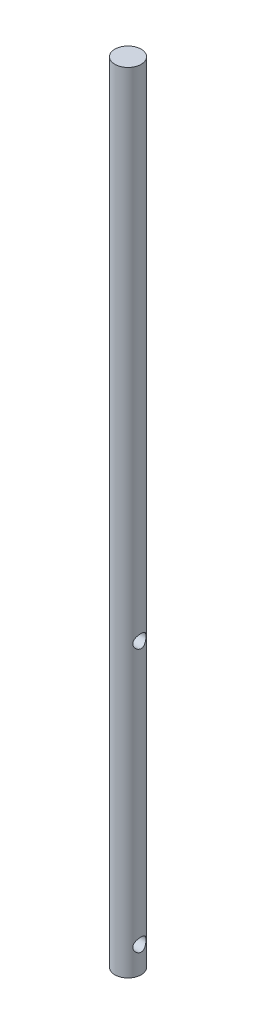
ISO-10303-21;
HEADER;
FILE_DESCRIPTION(('STEP AP214'),'2;1');
FILE_NAME('part.step','',(''),(''),'','','');
FILE_SCHEMA(('AUTOMOTIVE_DESIGN { 1 0 10303 214 1 1 1 1 }'));
ENDSEC;
DATA;
#1=APPLICATION_CONTEXT('core data for automotive mechanical design processes');
#2=APPLICATION_PROTOCOL_DEFINITION('international standard','automotive_design',2000,#1);
#3=PRODUCT_CONTEXT('',#1,'mechanical');
#4=PRODUCT('Part','Part','',(#3));
#5=PRODUCT_RELATED_PRODUCT_CATEGORY('part','',(#4));
#6=PRODUCT_DEFINITION_FORMATION('','',#4);
#7=PRODUCT_DEFINITION_CONTEXT('part definition',#1,'design');
#8=PRODUCT_DEFINITION('design','',#6,#7);
#9=PRODUCT_DEFINITION_SHAPE('','',#8);
#10=(LENGTH_UNIT() NAMED_UNIT(*) SI_UNIT(.MILLI.,.METRE.));
#11=(NAMED_UNIT(*) PLANE_ANGLE_UNIT() SI_UNIT($,.RADIAN.));
#12=(NAMED_UNIT(*) SI_UNIT($,.STERADIAN.) SOLID_ANGLE_UNIT());
#13=UNCERTAINTY_MEASURE_WITH_UNIT(LENGTH_MEASURE(1.E-05),#10,'distance_accuracy_value','');
#14=(GEOMETRIC_REPRESENTATION_CONTEXT(3) GLOBAL_UNCERTAINTY_ASSIGNED_CONTEXT((#13)) GLOBAL_UNIT_ASSIGNED_CONTEXT((#10,
#11,#12)) REPRESENTATION_CONTEXT('',''));
#15=CARTESIAN_POINT('',(0.,0.,0.));
#16=DIRECTION('',(0.,0.,1.));
#17=DIRECTION('',(1.,0.,0.));
#18=AXIS2_PLACEMENT_3D('',#15,#16,#17);
#19=CARTESIAN_POINT('',(0.,300.,0.));
#20=DIRECTION('',(0.,1.,0.));
#21=DIRECTION('',(0.,0.,1.));
#22=AXIS2_PLACEMENT_3D('',#19,#20,#21);
#23=PLANE('',#22);
#24=CARTESIAN_POINT('',(0.,300.,0.));
#25=DIRECTION('',(0.,-1.,0.));
#26=DIRECTION('',(0.,0.,-1.));
#27=AXIS2_PLACEMENT_3D('',#24,#25,#26);
#28=CIRCLE('',#27,5.);
#29=CARTESIAN_POINT('',(0.,300.,-5.));
#30=VERTEX_POINT('',#29);
#31=EDGE_CURVE('E75',#30,#30,#28,.T.);
#32=ORIENTED_EDGE('',*,*,#31,.F.);
#33=EDGE_LOOP('',(#32));
#34=FACE_BOUND('',#33,.T.);
#35=ADVANCED_FACE('F33',(#34),#23,.T.);
#36=CARTESIAN_POINT('',(0.,0.,0.));
#37=DIRECTION('',(0.,-1.,0.));
#38=DIRECTION('',(0.,0.,-1.));
#39=AXIS2_PLACEMENT_3D('',#36,#37,#38);
#40=CYLINDRICAL_SURFACE('',#39,5.);
#41=CARTESIAN_POINT('',(-4.33012701892239,110.,-2.49999999999965));
#42=CARTESIAN_POINT('',(-4.33013982273012,109.869733493124,-2.49998948436397));
#43=CARTESIAN_POINT('',(-4.33609541965603,109.739297279324,-2.48974954513133));
#44=CARTESIAN_POINT('',(-4.35905877051927,109.482431028471,-2.44930840724908));
#45=CARTESIAN_POINT('',(-4.37608974726042,109.356009995943,-2.41906526369509));
#46=CARTESIAN_POINT('',(-4.41873376871678,109.111371054439,-2.34024976997534));
#47=CARTESIAN_POINT('',(-4.4443011133894,108.993113426438,-2.29177485369926));
#48=CARTESIAN_POINT('',(-4.50106659111473,108.766439436905,-2.17816884056377));
#49=CARTESIAN_POINT('',(-4.53226502875901,108.658023608204,-2.11303684262633));
#50=CARTESIAN_POINT('',(-4.59992173524867,108.444235696083,-1.96166634317214));
#51=CARTESIAN_POINT('',(-4.63660159331593,108.33985216551,-1.87413008816877));
#52=CARTESIAN_POINT('',(-4.70929956727467,108.146479024287,-1.68313452122711));
#53=CARTESIAN_POINT('',(-4.74531734512781,108.057497092245,-1.57966731506011));
#54=CARTESIAN_POINT('',(-4.81553692452146,107.891582123514,-1.35122390789041));
#55=CARTESIAN_POINT('',(-4.84945266064082,107.815865580721,-1.22526797235854));
#56=CARTESIAN_POINT('',(-4.90876890230201,107.687147866516,-0.96039256667074));
#57=CARTESIAN_POINT('',(-4.93417477954541,107.634132359562,-0.821481345389576));
#58=CARTESIAN_POINT('',(-4.97201153115074,107.556238346836,-0.54511235977312));
#59=CARTESIAN_POINT('',(-4.98523700553428,107.529626184135,-0.408254476210585));
#60=CARTESIAN_POINT('',(-5.00018959613973,107.499584703289,-0.13142657175529));
#61=CARTESIAN_POINT('',(-5.00192366961168,107.496141358005,0.00854151460688804));
#62=CARTESIAN_POINT('',(-4.99407454791403,107.511866684931,0.274581311062335));
#63=CARTESIAN_POINT('',(-4.98546239730473,107.529095038805,0.400802997943041));
#64=CARTESIAN_POINT('',(-4.95935613149289,107.58220210976,0.648284429795474));
#65=CARTESIAN_POINT('',(-4.94186135165958,107.61808222244,0.769543802734988));
#66=CARTESIAN_POINT('',(-4.89928958219149,107.707706415225,1.00577347892443));
#67=CARTESIAN_POINT('',(-4.87411103822995,107.76169078293,1.12063355878835));
#68=CARTESIAN_POINT('',(-4.81844114966702,107.885658540504,1.33994200378363));
#69=CARTESIAN_POINT('',(-4.78794790393698,107.955647658256,1.44438662209695));
#70=CARTESIAN_POINT('',(-4.72110985998062,108.117238378833,1.65043415224586));
#71=CARTESIAN_POINT('',(-4.68448439995425,108.210257570815,1.75083518757376));
#72=CARTESIAN_POINT('',(-4.61135851467013,108.411474312325,1.93526092574481));
#73=CARTESIAN_POINT('',(-4.57485820664055,108.519683430685,2.01927302893594));
#74=CARTESIAN_POINT('',(-4.50360390231194,108.75662048106,2.1737633366059));
#75=CARTESIAN_POINT('',(-4.4691079997675,108.886215057636,2.24304328744549));
#76=CARTESIAN_POINT('',(-4.4093862569642,109.157344178398,2.35829778250344));
#77=CARTESIAN_POINT('',(-4.38415075115148,109.298866082544,2.40429664552759));
#78=CARTESIAN_POINT('',(-4.34861589542565,109.578036278207,2.46795052756296));
#79=CARTESIAN_POINT('',(-4.3372913962122,109.715102797609,2.48756280530029));
#80=CARTESIAN_POINT('',(-4.32794798404003,109.991003353791,2.50379236652891));
#81=CARTESIAN_POINT('',(-4.32991967223259,110.1298360728,2.50042589328791));
#82=CARTESIAN_POINT('',(-4.34585841351442,110.389134796447,2.47259010836025));
#83=CARTESIAN_POINT('',(-4.35848968766616,110.50994862777,2.4504695417815));
#84=CARTESIAN_POINT('',(-4.39235053878334,110.745919465678,2.38924071158146));
#85=CARTESIAN_POINT('',(-4.41358290012566,110.861074626867,2.35012694655943));
#86=CARTESIAN_POINT('',(-4.46340555199123,111.088528327256,2.25411897151252));
#87=CARTESIAN_POINT('',(-4.49229108107639,111.200447542133,2.19648515923198));
#88=CARTESIAN_POINT('',(-4.55390298743108,111.413673178849,2.06571766004006));
#89=CARTESIAN_POINT('',(-4.58663133387856,111.514974108788,1.9925760108316));
#90=CARTESIAN_POINT('',(-4.65719996140822,111.717446918803,1.82209291799672));
#91=CARTESIAN_POINT('',(-4.69516457885694,111.816992876772,1.72286318078471));
#92=CARTESIAN_POINT('',(-4.76835587444734,111.998530595006,1.50851123849917));
#93=CARTESIAN_POINT('',(-4.80358162519318,112.080516425659,1.39338368665026));
#94=CARTESIAN_POINT('',(-4.86853404227325,112.226434314791,1.14633840638546));
#95=CARTESIAN_POINT('',(-4.89809104179847,112.289832795208,1.014057743891));
#96=CARTESIAN_POINT('',(-4.94708387398465,112.392844759962,0.738805911647701));
#97=CARTESIAN_POINT('',(-4.96652859191741,112.432479129605,0.595844253647433));
#98=CARTESIAN_POINT('',(-4.99168770453965,112.483421409356,0.317449205675065));
#99=CARTESIAN_POINT('',(-4.99849819767836,112.49699468583,0.182528609085732));
#100=CARTESIAN_POINT('',(-5.00105325940468,112.502108167495,-0.0878149643370817));
#101=CARTESIAN_POINT('',(-4.99680170177043,112.493656085661,-0.223237748726671));
#102=CARTESIAN_POINT('',(-4.9783492208564,112.456458969604,-0.481344982670734));
#103=CARTESIAN_POINT('',(-4.9648223663681,112.429087828364,-0.604280801321436));
#104=CARTESIAN_POINT('',(-4.92980234191736,112.356682550242,-0.84361487366412));
#105=CARTESIAN_POINT('',(-4.90830802955524,112.311645880366,-0.960012187086878));
#106=CARTESIAN_POINT('',(-4.85814826741496,112.203182181261,-1.18855854199559));
#107=CARTESIAN_POINT('',(-4.82921542506811,112.13905097531,-1.30031295715329));
#108=CARTESIAN_POINT('',(-4.76720333344996,111.995105889852,-1.51193650408501));
#109=CARTESIAN_POINT('',(-4.73412218229116,111.915284807373,-1.61180014305363));
#110=CARTESIAN_POINT('',(-4.66321523550938,111.733004205551,-1.80728542324335));
#111=CARTESIAN_POINT('',(-4.6252448965838,111.629082273999,-1.90149582348968));
#112=CARTESIAN_POINT('',(-4.55157698284956,111.406384714618,-2.07165660492469));
#113=CARTESIAN_POINT('',(-4.51588143910601,111.287596085801,-2.14759083151505));
#114=CARTESIAN_POINT('',(-4.44998982823944,111.033363882336,-2.28108393395993));
#115=CARTESIAN_POINT('',(-4.42000320347002,110.897512611575,-2.33798627977414));
#116=CARTESIAN_POINT('',(-4.38370272660113,110.68677735048,-2.40494911880423));
#117=CARTESIAN_POINT('',(-4.37305486646074,110.615440224302,-2.42419582683955));
#118=CARTESIAN_POINT('',(-4.35507574170955,110.470959303151,-2.45635087255753));
#119=CARTESIAN_POINT('',(-4.34774215854254,110.397816809046,-2.46926364179141));
#120=CARTESIAN_POINT('',(-4.3382377954294,110.270499013453,-2.48591166201388));
#121=CARTESIAN_POINT('',(-4.33520487024811,110.216583678488,-2.49118864979167));
#122=CARTESIAN_POINT('',(-4.33114674911343,110.10845538369,-2.49823512543898));
#123=CARTESIAN_POINT('',(-4.33012168747281,110.054242404189,-2.50000437866439));
#124=CARTESIAN_POINT('',(-4.33012701892239,110.,-2.49999999999965));
#125=B_SPLINE_CURVE_WITH_KNOTS('',3,(#41,#42,#43,#44,#45,#46,#47,#48,#49,#50,#51,#52,#53,#54,
#55,#56,#57,#58,#59,#60,#61,#62,#63,#64,#65,#66,#67,#68,#69,#70,#71,#72,#73,#74,#75,#76,#77,#78,
#79,#80,#81,#82,#83,#84,#85,#86,#87,#88,#89,#90,#91,#92,#93,#94,#95,#96,#97,#98,#99,#100,#101,
#102,#103,#104,#105,#106,#107,#108,#109,#110,#111,#112,#113,#114,#115,#116,#117,#118,#119,#120,
#121,#122,#123,#124),.UNSPECIFIED.,.T.,.F.,(4,2,2,2,2,2,2,2,2,2,2,2,2,2,2,2,2,2,2,2,2,2,2,2,2,2,
2,2,2,2,2,2,2,2,2,2,2,2,2,2,2,4),(0.,0.390580306486802,0.781982232062036,1.17132148982696,
1.56068181366376,1.98215578129647,2.40383927716016,2.85394730601995,3.30377067414813,
3.72158712424921,4.13915059220181,4.52040243716427,4.90168281298718,5.28823836832948,
5.67493248380762,6.09817978647309,6.52175120619882,6.97222104328708,7.42221935534351,
7.83655727140617,8.25060232976017,8.61935458565148,8.98822631095238,9.37418241020299,
9.76033715555198,10.1951685895661,10.6301466245059,11.076604535375,11.5226694952701,
11.927806759788,12.3328021699001,12.7111106218382,13.0894733378512,13.4840187680376,
13.8787457525688,14.3127560463025,14.7471485711797,15.1952687260159,15.4189244153949,
15.6424233996907,15.8050484542806,15.9676843870379),.UNSPECIFIED.);
#126=CARTESIAN_POINT('',(-4.33012701892239,110.,-2.49999999999965));
#127=VERTEX_POINT('',#126);
#128=EDGE_CURVE('E10',#127,#127,#125,.T.);
#129=ORIENTED_EDGE('',*,*,#128,.F.);
#130=EDGE_LOOP('',(#129));
#131=FACE_BOUND('',#130,.T.);
#132=CARTESIAN_POINT('',(4.33012701892239,110.,-2.49999999999965));
#133=CARTESIAN_POINT('',(4.33013982273012,110.130266506877,-2.49998948436397));
#134=CARTESIAN_POINT('',(4.33609541965603,110.260702720676,-2.48974954513133));
#135=CARTESIAN_POINT('',(4.35905877051927,110.517568971529,-2.44930840724908));
#136=CARTESIAN_POINT('',(4.37608974726042,110.643990004057,-2.41906526369509));
#137=CARTESIAN_POINT('',(4.41873376871678,110.888628945561,-2.34024976997534));
#138=CARTESIAN_POINT('',(4.4443011133894,111.006886573562,-2.29177485369926));
#139=CARTESIAN_POINT('',(4.50106659111473,111.233560563095,-2.17816884056377));
#140=CARTESIAN_POINT('',(4.53226502875901,111.341976391796,-2.11303684262633));
#141=CARTESIAN_POINT('',(4.59992173524867,111.555764303917,-1.96166634317214));
#142=CARTESIAN_POINT('',(4.63660159331593,111.66014783449,-1.87413008816877));
#143=CARTESIAN_POINT('',(4.70929956727467,111.853520975713,-1.68313452122711));
#144=CARTESIAN_POINT('',(4.74531734512781,111.942502907755,-1.57966731506011));
#145=CARTESIAN_POINT('',(4.81553692452146,112.108417876486,-1.35122390789041));
#146=CARTESIAN_POINT('',(4.84945266064082,112.184134419279,-1.22526797235854));
#147=CARTESIAN_POINT('',(4.90876890230201,112.312852133484,-0.96039256667074));
#148=CARTESIAN_POINT('',(4.93417477954541,112.365867640439,-0.821481345389576));
#149=CARTESIAN_POINT('',(4.97201153115074,112.443761653164,-0.545112359773122));
#150=CARTESIAN_POINT('',(4.98523700553428,112.470373815865,-0.408254476210588));
#151=CARTESIAN_POINT('',(5.00018959613974,112.500415296711,-0.131426571755293));
#152=CARTESIAN_POINT('',(5.00192366961168,112.503858641995,0.00854151460688658));
#153=CARTESIAN_POINT('',(4.99407454791403,112.488133315069,0.274581311062335));
#154=CARTESIAN_POINT('',(4.98546239730473,112.470904961195,0.400802997943041));
#155=CARTESIAN_POINT('',(4.95935613149289,112.41779789024,0.648284429795474));
#156=CARTESIAN_POINT('',(4.94186135165958,112.38191777756,0.769543802734988));
#157=CARTESIAN_POINT('',(4.89928958219149,112.292293584775,1.00577347892443));
#158=CARTESIAN_POINT('',(4.87411103822995,112.23830921707,1.12063355878835));
#159=CARTESIAN_POINT('',(4.81844114966702,112.114341459496,1.33994200378363));
#160=CARTESIAN_POINT('',(4.78794790393698,112.044352341744,1.44438662209695));
#161=CARTESIAN_POINT('',(4.72110985998062,111.882761621167,1.65043415224586));
#162=CARTESIAN_POINT('',(4.68448439995424,111.789742429185,1.75083518757377));
#163=CARTESIAN_POINT('',(4.61135851467013,111.588525687675,1.93526092574481));
#164=CARTESIAN_POINT('',(4.57485820664055,111.480316569315,2.01927302893594));
#165=CARTESIAN_POINT('',(4.50360390231194,111.24337951894,2.1737633366059));
#166=CARTESIAN_POINT('',(4.4691079997675,111.113784942364,2.24304328744549));
#167=CARTESIAN_POINT('',(4.4093862569642,110.842655821602,2.35829778250344));
#168=CARTESIAN_POINT('',(4.38415075115148,110.701133917456,2.40429664552759));
#169=CARTESIAN_POINT('',(4.34861589542565,110.421963721793,2.46795052756296));
#170=CARTESIAN_POINT('',(4.3372913962122,110.284897202391,2.48756280530029));
#171=CARTESIAN_POINT('',(4.32794798404003,110.008996646209,2.50379236652891));
#172=CARTESIAN_POINT('',(4.32991967223259,109.8701639272,2.50042589328791));
#173=CARTESIAN_POINT('',(4.34585841351442,109.610865203553,2.47259010836025));
#174=CARTESIAN_POINT('',(4.35848968766616,109.49005137223,2.4504695417815));
#175=CARTESIAN_POINT('',(4.39235053878334,109.254080534323,2.38924071158146));
#176=CARTESIAN_POINT('',(4.41358290012566,109.138925373133,2.35012694655943));
#177=CARTESIAN_POINT('',(4.46340555199123,108.911471672744,2.25411897151252));
#178=CARTESIAN_POINT('',(4.49229108107639,108.799552457867,2.19648515923198));
#179=CARTESIAN_POINT('',(4.55390298743108,108.586326821151,2.06571766004006));
#180=CARTESIAN_POINT('',(4.58663133387856,108.485025891212,1.9925760108316));
#181=CARTESIAN_POINT('',(4.65719996140822,108.282553081197,1.82209291799672));
#182=CARTESIAN_POINT('',(4.69516457885694,108.183007123228,1.72286318078471));
#183=CARTESIAN_POINT('',(4.76835587444734,108.001469404994,1.50851123849917));
#184=CARTESIAN_POINT('',(4.80358162519318,107.919483574341,1.39338368665026));
#185=CARTESIAN_POINT('',(4.86853404227325,107.773565685209,1.14633840638546));
#186=CARTESIAN_POINT('',(4.89809104179847,107.710167204792,1.014057743891));
#187=CARTESIAN_POINT('',(4.94708387398465,107.607155240038,0.738805911647701));
#188=CARTESIAN_POINT('',(4.96652859191741,107.567520870395,0.595844253647433));
#189=CARTESIAN_POINT('',(4.99168770453965,107.516578590644,0.317449205675065));
#190=CARTESIAN_POINT('',(4.99849819767836,107.50300531417,0.182528609085732));
#191=CARTESIAN_POINT('',(5.00105325940468,107.497891832505,-0.0878149643370815));
#192=CARTESIAN_POINT('',(4.99680170177043,107.506343914339,-0.22323774872667));
#193=CARTESIAN_POINT('',(4.9783492208564,107.543541030396,-0.48134498267073));
#194=CARTESIAN_POINT('',(4.9648223663681,107.570912171636,-0.60428080132143));
#195=CARTESIAN_POINT('',(4.92980234191737,107.643317449758,-0.843614873664114));
#196=CARTESIAN_POINT('',(4.90830802955524,107.688354119634,-0.960012187086874));
#197=CARTESIAN_POINT('',(4.85814826741496,107.796817818739,-1.18855854199559));
#198=CARTESIAN_POINT('',(4.82921542506811,107.86094902469,-1.30031295715329));
#199=CARTESIAN_POINT('',(4.76720333344996,108.004894110148,-1.51193650408501));
#200=CARTESIAN_POINT('',(4.73412218229116,108.084715192627,-1.61180014305363));
#201=CARTESIAN_POINT('',(4.66321523550938,108.266995794449,-1.80728542324335));
#202=CARTESIAN_POINT('',(4.6252448965838,108.370917726001,-1.90149582348968));
#203=CARTESIAN_POINT('',(4.55157698284956,108.593615285382,-2.07165660492469));
#204=CARTESIAN_POINT('',(4.51588143910601,108.712403914199,-2.14759083151505));
#205=CARTESIAN_POINT('',(4.44998982823944,108.966636117664,-2.28108393395993));
#206=CARTESIAN_POINT('',(4.42000320347002,109.102487388425,-2.33798627977414));
#207=CARTESIAN_POINT('',(4.38370272660113,109.31322264952,-2.40494911880423));
#208=CARTESIAN_POINT('',(4.37305486646074,109.384559775698,-2.42419582683955));
#209=CARTESIAN_POINT('',(4.35507574170955,109.529040696849,-2.45635087255753));
#210=CARTESIAN_POINT('',(4.34774215854254,109.602183190954,-2.46926364179141));
#211=CARTESIAN_POINT('',(4.3382377954294,109.729500986547,-2.48591166201388));
#212=CARTESIAN_POINT('',(4.33520487024811,109.783416321512,-2.49118864979167));
#213=CARTESIAN_POINT('',(4.33114674911343,109.89154461631,-2.49823512543898));
#214=CARTESIAN_POINT('',(4.33012168747281,109.945757595811,-2.50000437866439));
#215=CARTESIAN_POINT('',(4.33012701892239,110.,-2.49999999999965));
#216=B_SPLINE_CURVE_WITH_KNOTS('',3,(#132,#133,#134,#135,#136,#137,#138,#139,#140,#141,#142,
#143,#144,#145,#146,#147,#148,#149,#150,#151,#152,#153,#154,#155,#156,#157,#158,#159,#160,#161,
#162,#163,#164,#165,#166,#167,#168,#169,#170,#171,#172,#173,#174,#175,#176,#177,#178,#179,#180,
#181,#182,#183,#184,#185,#186,#187,#188,#189,#190,#191,#192,#193,#194,#195,#196,#197,#198,#199,
#200,#201,#202,#203,#204,#205,#206,#207,#208,#209,#210,#211,#212,#213,#214,#215),.UNSPECIFIED.,
.T.,.F.,(4,2,2,2,2,2,2,2,2,2,2,2,2,2,2,2,2,2,2,2,2,2,2,2,2,2,2,2,2,2,2,2,2,2,2,2,2,2,2,2,2,4),
(0.,0.390580306486802,0.781982232062036,1.17132148982696,1.56068181366376,1.98215578129647,
2.40383927716016,2.85394730601995,3.30377067414813,3.72158712424921,4.13915059220181,
4.52040243716427,4.90168281298718,5.28823836832948,5.67493248380762,6.09817978647311,
6.52175120619881,6.97222104328708,7.42221935534351,7.83655727140617,8.25060232976017,
8.61935458565148,8.98822631095238,9.37418241020299,9.76033715555198,10.1951685895661,
10.6301466245059,11.076604535375,11.5226694952701,11.927806759788,12.3328021699001,
12.7111106218382,13.0894733378512,13.4840187680377,13.8787457525688,14.3127560463025,
14.7471485711797,15.1952687260159,15.4189244153949,15.6424233996907,15.8050484542806,
15.9676843870379),.UNSPECIFIED.);
#217=CARTESIAN_POINT('',(4.33012701892239,110.,-2.49999999999965));
#218=VERTEX_POINT('',#217);
#219=EDGE_CURVE('E42',#218,#218,#216,.T.);
#220=ORIENTED_EDGE('',*,*,#219,.F.);
#221=EDGE_LOOP('',(#220));
#222=FACE_BOUND('',#221,.T.);
#223=CARTESIAN_POINT('',(-4.33012701892219,10.,-2.5));
#224=CARTESIAN_POINT('',(-4.33013982272991,9.86973349312351,-2.49998948436432));
#225=CARTESIAN_POINT('',(-4.33609541965583,9.73929727932375,-2.48974954513168));
#226=CARTESIAN_POINT('',(-4.35905877051907,9.48243102847077,-2.44930840724944));
#227=CARTESIAN_POINT('',(-4.37608974726022,9.35600999594271,-2.41906526369545));
#228=CARTESIAN_POINT('',(-4.41873376871658,9.11137105443894,-2.3402497699757));
#229=CARTESIAN_POINT('',(-4.44430111338921,8.99311342643779,-2.29177485369963));
#230=CARTESIAN_POINT('',(-4.50106659111455,8.76643943690546,-2.17816884056414));
#231=CARTESIAN_POINT('',(-4.53226502875883,8.65802360820421,-2.11303684262671));
#232=CARTESIAN_POINT('',(-4.59992173524851,8.44423569608308,-1.96166634317253));
#233=CARTESIAN_POINT('',(-4.63660159331577,8.33985216551024,-1.87413008816917));
#234=CARTESIAN_POINT('',(-4.70929956727453,8.1464790242868,-1.68313452122752));
#235=CARTESIAN_POINT('',(-4.74531734512768,8.05749709224505,-1.57966731506051));
#236=CARTESIAN_POINT('',(-4.81553692452134,7.89158212351436,-1.35122390789082));
#237=CARTESIAN_POINT('',(-4.84945266064072,7.81586558072086,-1.22526797235894));
#238=CARTESIAN_POINT('',(-4.90876890230193,7.68714786651614,-0.960392566671147));
#239=CARTESIAN_POINT('',(-4.93417477954535,7.63413235956151,-0.821481345389983));
#240=CARTESIAN_POINT('',(-4.9720115311507,7.55623834683603,-0.545112359773522));
#241=CARTESIAN_POINT('',(-4.98523700553425,7.52962618413488,-0.408254476210982));
#242=CARTESIAN_POINT('',(-5.00018959613973,7.49958470328871,-0.131426571755676));
#243=CARTESIAN_POINT('',(-5.00192366961168,7.49614135800465,0.00854151460650884));
#244=CARTESIAN_POINT('',(-4.99407454791405,7.51186668493143,0.274581311061965));
#245=CARTESIAN_POINT('',(-4.98546239730476,7.52909503880455,0.400802997942673));
#246=CARTESIAN_POINT('',(-4.95935613149293,7.58220210976016,0.64828442979511));
#247=CARTESIAN_POINT('',(-4.94186135165964,7.61808222244016,0.769543802734626));
#248=CARTESIAN_POINT('',(-4.89928958219156,7.70770641522494,1.00577347892407));
#249=CARTESIAN_POINT('',(-4.87411103823003,7.76169078293028,1.120633558788));
#250=CARTESIAN_POINT('',(-4.81844114966712,7.88565854050362,1.33994200378327));
#251=CARTESIAN_POINT('',(-4.78794790393709,7.95564765825584,1.4443866220966));
#252=CARTESIAN_POINT('',(-4.72110985998074,8.11723837883257,1.6504341522455));
#253=CARTESIAN_POINT('',(-4.68448439995438,8.21025757081503,1.7508351875734));
#254=CARTESIAN_POINT('',(-4.61135851467028,8.41147431232543,1.93526092574445));
#255=CARTESIAN_POINT('',(-4.57485820664072,8.51968343068515,2.01927302893558));
#256=CARTESIAN_POINT('',(-4.50360390231211,8.75662048106022,2.17376333660553));
#257=CARTESIAN_POINT('',(-4.46910799976769,8.88621505763553,2.24304328744513));
#258=CARTESIAN_POINT('',(-4.40938625696439,9.1573441783975,2.35829778250308));
#259=CARTESIAN_POINT('',(-4.38415075115168,9.29886608254391,2.40429664552722));
#260=CARTESIAN_POINT('',(-4.34861589542586,9.57803627820698,2.4679505275626));
#261=CARTESIAN_POINT('',(-4.33729139621241,9.71510279760887,2.48756280529994));
#262=CARTESIAN_POINT('',(-4.32794798404024,9.99100335379137,2.50379236652857));
#263=CARTESIAN_POINT('',(-4.32991967223279,10.1298360727995,2.50042589328757));
#264=CARTESIAN_POINT('',(-4.34585841351462,10.3891347964468,2.47259010835991));
#265=CARTESIAN_POINT('',(-4.35848968766635,10.5099486277697,2.45046954178116));
#266=CARTESIAN_POINT('',(-4.39235053878352,10.7459194656775,2.38924071158112));
#267=CARTESIAN_POINT('',(-4.41358290012584,10.8610746268669,2.35012694655908));
#268=CARTESIAN_POINT('',(-4.46340555199141,11.0885283272564,2.25411897151217));
#269=CARTESIAN_POINT('',(-4.49229108107657,11.2004475421326,2.19648515923162));
#270=CARTESIAN_POINT('',(-4.55390298743125,11.4136731788488,2.0657176600397));
#271=CARTESIAN_POINT('',(-4.58663133387872,11.5149741087881,1.99257601083123));
#272=CARTESIAN_POINT('',(-4.65719996140836,11.7174469188033,1.82209291799636));
#273=CARTESIAN_POINT('',(-4.69516457885707,11.8169928767722,1.72286318078435));
#274=CARTESIAN_POINT('',(-4.76835587444746,11.9985305950059,1.5085112384988));
#275=CARTESIAN_POINT('',(-4.80358162519329,12.0805164256585,1.39338368664988));
#276=CARTESIAN_POINT('',(-4.86853404227334,12.2264343147909,1.14633840638507));
#277=CARTESIAN_POINT('',(-4.89809104179855,12.2898327952085,1.01405774389062));
#278=CARTESIAN_POINT('',(-4.9470838739847,12.392844759962,0.738805911647331));
#279=CARTESIAN_POINT('',(-4.96652859191746,12.4324791296051,0.595844253647066));
#280=CARTESIAN_POINT('',(-4.99168770453968,12.4834214093564,0.317449205674705));
#281=CARTESIAN_POINT('',(-4.99849819767837,12.4969946858303,0.182528609085376));
#282=CARTESIAN_POINT('',(-5.00105325940467,12.5021081674946,-0.0878149643374315));
#283=CARTESIAN_POINT('',(-4.99680170177041,12.4936560856611,-0.223237748727017));
#284=CARTESIAN_POINT('',(-4.97834922085636,12.4564589696045,-0.481344982671074));
#285=CARTESIAN_POINT('',(-4.96482236636806,12.4290878283637,-0.604280801321773));
#286=CARTESIAN_POINT('',(-4.92980234191731,12.3566825502417,-0.843614873664456));
#287=CARTESIAN_POINT('',(-4.90830802955517,12.3116458803664,-0.960012187087214));
#288=CARTESIAN_POINT('',(-4.85814826741488,12.2031821812607,-1.18855854199593));
#289=CARTESIAN_POINT('',(-4.82921542506802,12.1390509753102,-1.30031295715363));
#290=CARTESIAN_POINT('',(-4.76720333344985,11.9951058898524,-1.51193650408535));
#291=CARTESIAN_POINT('',(-4.73412218229104,11.9152848073731,-1.61180014305397));
#292=CARTESIAN_POINT('',(-4.66321523550925,11.7330042055506,-1.8072854232437));
#293=CARTESIAN_POINT('',(-4.62524489658366,11.6290822739993,-1.90149582349003));
#294=CARTESIAN_POINT('',(-4.55157698284941,11.4063847146178,-2.07165660492504));
#295=CARTESIAN_POINT('',(-4.51588143910584,11.2875960858008,-2.1475908315154));
#296=CARTESIAN_POINT('',(-4.44998982823926,11.0333638823357,-2.28108393396029));
#297=CARTESIAN_POINT('',(-4.42000320346983,10.8975126115754,-2.3379862797745));
#298=CARTESIAN_POINT('',(-4.38370272660093,10.6867773504802,-2.40494911880459));
#299=CARTESIAN_POINT('',(-4.37305486646054,10.6154402243024,-2.42419582683991));
#300=CARTESIAN_POINT('',(-4.35507574170934,10.4709593031507,-2.45635087255789));
#301=CARTESIAN_POINT('',(-4.34774215854234,10.3978168090456,-2.46926364179176));
#302=CARTESIAN_POINT('',(-4.3382377954292,10.2704990134531,-2.48591166201423));
#303=CARTESIAN_POINT('',(-4.33520487024791,10.2165836784878,-2.49118864979202));
#304=CARTESIAN_POINT('',(-4.33114674911322,10.1084553836896,-2.49823512543934));
#305=CARTESIAN_POINT('',(-4.33012168747261,10.0542424041894,-2.50000437866474));
#306=CARTESIAN_POINT('',(-4.33012701892219,10.,-2.5));
#307=B_SPLINE_CURVE_WITH_KNOTS('',3,(#223,#224,#225,#226,#227,#228,#229,#230,#231,#232,#233,
#234,#235,#236,#237,#238,#239,#240,#241,#242,#243,#244,#245,#246,#247,#248,#249,#250,#251,#252,
#253,#254,#255,#256,#257,#258,#259,#260,#261,#262,#263,#264,#265,#266,#267,#268,#269,#270,#271,
#272,#273,#274,#275,#276,#277,#278,#279,#280,#281,#282,#283,#284,#285,#286,#287,#288,#289,#290,
#291,#292,#293,#294,#295,#296,#297,#298,#299,#300,#301,#302,#303,#304,#305,#306),.UNSPECIFIED.,
.T.,.F.,(4,2,2,2,2,2,2,2,2,2,2,2,2,2,2,2,2,2,2,2,2,2,2,2,2,2,2,2,2,2,2,2,2,2,2,2,2,2,2,2,2,4),
(0.,0.39058030648679,0.781982232062012,1.17132148982692,1.56068181366371,1.98215578129642,
2.40383927716011,2.85394730601992,3.30377067414811,3.72158712424921,4.13915059220183,
4.52040243716429,4.90168281298721,5.2882383683295,5.67493248380763,6.0981797864731,
6.5217512061988,6.97222104328704,7.42221935534346,7.83655727140613,8.25060232976016,
8.61935458565147,8.98822631095241,9.37418241020302,9.76033715555202,10.1951685895662,
10.6301466245059,11.076604535375,11.5226694952701,11.927806759788,12.3328021699001,
12.7111106218381,13.0894733378512,13.4840187680376,13.8787457525688,14.3127560463025,
14.7471485711797,15.195268726016,15.4189244153949,15.6424233996907,15.8050484542806,
15.9676843870379),.UNSPECIFIED.);
#308=CARTESIAN_POINT('',(-4.33012701892219,10.,-2.5));
#309=VERTEX_POINT('',#308);
#310=EDGE_CURVE('E46',#309,#309,#307,.T.);
#311=ORIENTED_EDGE('',*,*,#310,.F.);
#312=EDGE_LOOP('',(#311));
#313=FACE_BOUND('',#312,.T.);
#314=CARTESIAN_POINT('',(4.33012701892219,10.,-2.5));
#315=CARTESIAN_POINT('',(4.33013982272991,10.1302665068765,-2.49998948436432));
#316=CARTESIAN_POINT('',(4.33609541965583,10.2607027206763,-2.48974954513168));
#317=CARTESIAN_POINT('',(4.35905877051907,10.5175689715292,-2.44930840724944));
#318=CARTESIAN_POINT('',(4.37608974726023,10.6439900040573,-2.41906526369545));
#319=CARTESIAN_POINT('',(4.41873376871658,10.8886289455611,-2.3402497699757));
#320=CARTESIAN_POINT('',(4.44430111338921,11.0068865735622,-2.29177485369963));
#321=CARTESIAN_POINT('',(4.50106659111455,11.2335605630945,-2.17816884056414));
#322=CARTESIAN_POINT('',(4.53226502875883,11.3419763917958,-2.11303684262671));
#323=CARTESIAN_POINT('',(4.59992173524851,11.5557643039169,-1.96166634317253));
#324=CARTESIAN_POINT('',(4.63660159331577,11.6601478344898,-1.87413008816917));
#325=CARTESIAN_POINT('',(4.70929956727453,11.8535209757132,-1.68313452122752));
#326=CARTESIAN_POINT('',(4.74531734512768,11.942502907755,-1.57966731506051));
#327=CARTESIAN_POINT('',(4.81553692452134,12.1084178764856,-1.35122390789082));
#328=CARTESIAN_POINT('',(4.84945266064072,12.1841344192791,-1.22526797235894));
#329=CARTESIAN_POINT('',(4.90876890230193,12.3128521334839,-0.960392566671147));
#330=CARTESIAN_POINT('',(4.93417477954535,12.3658676404385,-0.821481345389983));
#331=CARTESIAN_POINT('',(4.9720115311507,12.443761653164,-0.545112359773523));
#332=CARTESIAN_POINT('',(4.98523700553425,12.4703738158651,-0.408254476210983));
#333=CARTESIAN_POINT('',(5.00018959613973,12.5004152967113,-0.131426571755677));
#334=CARTESIAN_POINT('',(5.00192366961168,12.5038586419954,0.00854151460650797));
#335=CARTESIAN_POINT('',(4.99407454791405,12.4881333150686,0.274581311061964));
#336=CARTESIAN_POINT('',(4.98546239730476,12.4709049611955,0.400802997942672));
#337=CARTESIAN_POINT('',(4.95935613149293,12.4177978902398,0.648284429795109));
#338=CARTESIAN_POINT('',(4.94186135165964,12.3819177775598,0.769543802734625));
#339=CARTESIAN_POINT('',(4.89928958219156,12.2922935847751,1.00577347892407));
#340=CARTESIAN_POINT('',(4.87411103823003,12.2383092170697,1.12063355878799));
#341=CARTESIAN_POINT('',(4.81844114966712,12.1143414594964,1.33994200378327));
#342=CARTESIAN_POINT('',(4.78794790393708,12.0443523417442,1.4443866220966));
#343=CARTESIAN_POINT('',(4.72110985998074,11.8827616211674,1.6504341522455));
#344=CARTESIAN_POINT('',(4.68448439995438,11.789742429185,1.75083518757341));
#345=CARTESIAN_POINT('',(4.61135851467028,11.5885256876746,1.93526092574445));
#346=CARTESIAN_POINT('',(4.57485820664072,11.4803165693148,2.01927302893558));
#347=CARTESIAN_POINT('',(4.50360390231211,11.2433795189398,2.17376333660553));
#348=CARTESIAN_POINT('',(4.46910799976769,11.1137849423645,2.24304328744513));
#349=CARTESIAN_POINT('',(4.40938625696439,10.8426558216025,2.35829778250308));
#350=CARTESIAN_POINT('',(4.38415075115168,10.7011339174561,2.40429664552722));
#351=CARTESIAN_POINT('',(4.34861589542586,10.421963721793,2.4679505275626));
#352=CARTESIAN_POINT('',(4.33729139621241,10.2848972023911,2.48756280529994));
#353=CARTESIAN_POINT('',(4.32794798404024,10.0089966462086,2.50379236652857));
#354=CARTESIAN_POINT('',(4.32991967223279,9.87016392720051,2.50042589328757));
#355=CARTESIAN_POINT('',(4.34585841351462,9.61086520355321,2.47259010835991));
#356=CARTESIAN_POINT('',(4.35848968766635,9.49005137223027,2.45046954178116));
#357=CARTESIAN_POINT('',(4.39235053878352,9.25408053432252,2.38924071158112));
#358=CARTESIAN_POINT('',(4.41358290012584,9.13892537313315,2.35012694655908));
#359=CARTESIAN_POINT('',(4.46340555199141,8.91147167274361,2.25411897151217));
#360=CARTESIAN_POINT('',(4.49229108107657,8.79955245786744,2.19648515923163));
#361=CARTESIAN_POINT('',(4.55390298743125,8.5863268211512,2.0657176600397));
#362=CARTESIAN_POINT('',(4.58663133387872,8.48502589121187,1.99257601083123));
#363=CARTESIAN_POINT('',(4.65719996140836,8.28255308119668,1.82209291799636));
#364=CARTESIAN_POINT('',(4.69516457885707,8.18300712322778,1.72286318078435));
#365=CARTESIAN_POINT('',(4.76835587444746,8.00146940499409,1.5085112384988));
#366=CARTESIAN_POINT('',(4.80358162519329,7.91948357434145,1.39338368664989));
#367=CARTESIAN_POINT('',(4.86853404227334,7.77356568520911,1.14633840638508));
#368=CARTESIAN_POINT('',(4.89809104179855,7.71016720479154,1.01405774389062));
#369=CARTESIAN_POINT('',(4.9470838739847,7.60715524003798,0.738805911647332));
#370=CARTESIAN_POINT('',(4.96652859191746,7.56752087039488,0.595844253647067));
#371=CARTESIAN_POINT('',(4.99168770453968,7.51657859064358,0.317449205674705));
#372=CARTESIAN_POINT('',(4.99849819767837,7.50300531416966,0.182528609085376));
#373=CARTESIAN_POINT('',(5.00105325940467,7.49789183250541,-0.0878149643374311));
#374=CARTESIAN_POINT('',(4.99680170177041,7.50634391433892,-0.223237748727017));
#375=CARTESIAN_POINT('',(4.97834922085636,7.54354103039551,-0.481344982671073));
#376=CARTESIAN_POINT('',(4.96482236636806,7.57091217163632,-0.604280801321773));
#377=CARTESIAN_POINT('',(4.92980234191731,7.64331744975833,-0.843614873664455));
#378=CARTESIAN_POINT('',(4.90830802955517,7.68835411963363,-0.960012187087213));
#379=CARTESIAN_POINT('',(4.85814826741488,7.79681781873926,-1.18855854199593));
#380=CARTESIAN_POINT('',(4.82921542506802,7.86094902468985,-1.30031295715363));
#381=CARTESIAN_POINT('',(4.76720333344985,8.00489411014759,-1.51193650408535));
#382=CARTESIAN_POINT('',(4.73412218229104,8.08471519262687,-1.61180014305397));
#383=CARTESIAN_POINT('',(4.66321523550925,8.26699579444936,-1.8072854232437));
#384=CARTESIAN_POINT('',(4.62524489658366,8.37091772600073,-1.90149582349002));
#385=CARTESIAN_POINT('',(4.55157698284941,8.59361528538223,-2.07165660492503));
#386=CARTESIAN_POINT('',(4.51588143910584,8.71240391419923,-2.1475908315154));
#387=CARTESIAN_POINT('',(4.44998982823926,8.96663611766426,-2.28108393396028));
#388=CARTESIAN_POINT('',(4.42000320346983,9.10248738842461,-2.3379862797745));
#389=CARTESIAN_POINT('',(4.38370272660093,9.31322264951978,-2.40494911880459));
#390=CARTESIAN_POINT('',(4.37305486646054,9.38455977569761,-2.42419582683991));
#391=CARTESIAN_POINT('',(4.35507574170934,9.52904069684934,-2.45635087255789));
#392=CARTESIAN_POINT('',(4.34774215854234,9.60218319095442,-2.46926364179176));
#393=CARTESIAN_POINT('',(4.3382377954292,9.72950098654694,-2.48591166201423));
#394=CARTESIAN_POINT('',(4.33520487024791,9.78341632151221,-2.49118864979202));
#395=CARTESIAN_POINT('',(4.33114674911322,9.89154461631041,-2.49823512543933));
#396=CARTESIAN_POINT('',(4.33012168747261,9.94575759581055,-2.50000437866474));
#397=CARTESIAN_POINT('',(4.33012701892219,10.,-2.5));
#398=B_SPLINE_CURVE_WITH_KNOTS('',3,(#314,#315,#316,#317,#318,#319,#320,#321,#322,#323,#324,
#325,#326,#327,#328,#329,#330,#331,#332,#333,#334,#335,#336,#337,#338,#339,#340,#341,#342,#343,
#344,#345,#346,#347,#348,#349,#350,#351,#352,#353,#354,#355,#356,#357,#358,#359,#360,#361,#362,
#363,#364,#365,#366,#367,#368,#369,#370,#371,#372,#373,#374,#375,#376,#377,#378,#379,#380,#381,
#382,#383,#384,#385,#386,#387,#388,#389,#390,#391,#392,#393,#394,#395,#396,#397),.UNSPECIFIED.,
.T.,.F.,(4,2,2,2,2,2,2,2,2,2,2,2,2,2,2,2,2,2,2,2,2,2,2,2,2,2,2,2,2,2,2,2,2,2,2,2,2,2,2,2,2,4),
(0.,0.39058030648679,0.781982232062012,1.17132148982692,1.56068181366371,1.98215578129642,
2.40383927716011,2.85394730601992,3.30377067414811,3.72158712424921,4.13915059220183,
4.52040243716429,4.90168281298721,5.2882383683295,5.67493248380763,6.0981797864731,
6.5217512061988,6.97222104328704,7.42221935534345,7.83655727140613,8.25060232976016,
8.61935458565147,8.98822631095241,9.37418241020302,9.76033715555202,10.1951685895662,
10.6301466245059,11.076604535375,11.5226694952701,11.927806759788,12.3328021699001,
12.7111106218381,13.0894733378512,13.4840187680376,13.8787457525688,14.3127560463025,
14.7471485711797,15.195268726016,15.4189244153949,15.6424233996907,15.8050484542806,
15.9676843870379),.UNSPECIFIED.);
#399=CARTESIAN_POINT('',(4.33012701892219,10.,-2.5));
#400=VERTEX_POINT('',#399);
#401=EDGE_CURVE('E50',#400,#400,#398,.T.);
#402=ORIENTED_EDGE('',*,*,#401,.F.);
#403=EDGE_LOOP('',(#402));
#404=FACE_BOUND('',#403,.T.);
#405=ORIENTED_EDGE('',*,*,#31,.T.);
#406=EDGE_LOOP('',(#405));
#407=FACE_BOUND('',#406,.T.);
#408=CARTESIAN_POINT('',(0.,0.,0.));
#409=DIRECTION('',(0.,-1.,0.));
#410=DIRECTION('',(0.,0.,-1.));
#411=AXIS2_PLACEMENT_3D('',#408,#409,#410);
#412=CIRCLE('',#411,5.);
#413=CARTESIAN_POINT('',(0.,0.,-5.));
#414=VERTEX_POINT('',#413);
#415=EDGE_CURVE('E78',#414,#414,#412,.T.);
#416=ORIENTED_EDGE('',*,*,#415,.F.);
#417=EDGE_LOOP('',(#416));
#418=FACE_BOUND('',#417,.T.);
#419=ADVANCED_FACE('F58',(#131,#222,#313,#404,#407,#418),#40,.T.);
#420=CARTESIAN_POINT('',(0.,0.,0.));
#421=DIRECTION('',(0.,-1.,0.));
#422=DIRECTION('',(0.,0.,-1.));
#423=AXIS2_PLACEMENT_3D('',#420,#421,#422);
#424=PLANE('',#423);
#425=ORIENTED_EDGE('',*,*,#415,.T.);
#426=EDGE_LOOP('',(#425));
#427=FACE_BOUND('',#426,.T.);
#428=ADVANCED_FACE('F68',(#427),#424,.T.);
#429=CARTESIAN_POINT('',(-5.,10.,0.));
#430=DIRECTION('',(1.,0.,0.));
#431=DIRECTION('',(0.,0.,-1.));
#432=AXIS2_PLACEMENT_3D('',#429,#430,#431);
#433=CYLINDRICAL_SURFACE('',#432,2.5);
#434=ORIENTED_EDGE('',*,*,#310,.T.);
#435=EDGE_LOOP('',(#434));
#436=FACE_BOUND('',#435,.T.);
#437=ORIENTED_EDGE('',*,*,#401,.T.);
#438=EDGE_LOOP('',(#437));
#439=FACE_BOUND('',#438,.T.);
#440=ADVANCED_FACE('F64',(#436,#439),#433,.F.);
#441=CARTESIAN_POINT('',(-5.,110.,3.49148133884313E-13));
#442=DIRECTION('',(1.,0.,0.));
#443=DIRECTION('',(0.,0.,-1.));
#444=AXIS2_PLACEMENT_3D('',#441,#442,#443);
#445=CYLINDRICAL_SURFACE('',#444,2.5);
#446=ORIENTED_EDGE('',*,*,#128,.T.);
#447=EDGE_LOOP('',(#446));
#448=FACE_BOUND('',#447,.T.);
#449=ORIENTED_EDGE('',*,*,#219,.T.);
#450=EDGE_LOOP('',(#449));
#451=FACE_BOUND('',#450,.T.);
#452=ADVANCED_FACE('F61',(#448,#451),#445,.F.);
#453=CLOSED_SHELL('',(#35,#419,#428,#440,#452));
#454=MANIFOLD_SOLID_BREP('B2',#453);
#455=ADVANCED_BREP_SHAPE_REPRESENTATION('',(#18,#454),#14);
#456=SHAPE_DEFINITION_REPRESENTATION(#9,#455);
ENDSEC;
END-ISO-10303-21;
